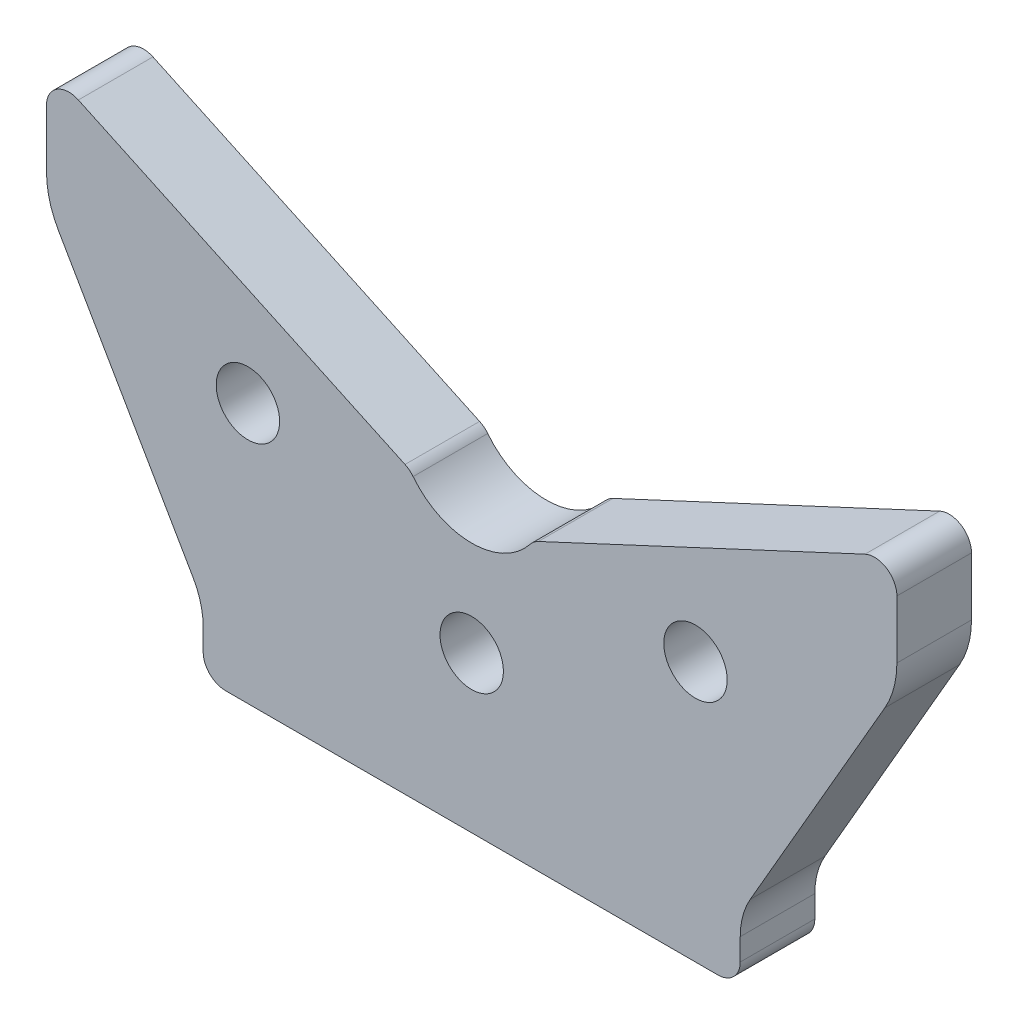
ISO-10303-21;
HEADER;
FILE_DESCRIPTION(('STEP AP214'),'2;1');
FILE_NAME('part.step','',(''),(''),'','','');
FILE_SCHEMA(('AUTOMOTIVE_DESIGN { 1 0 10303 214 1 1 1 1 }'));
ENDSEC;
DATA;
#1=APPLICATION_CONTEXT('core data for automotive mechanical design processes');
#2=APPLICATION_PROTOCOL_DEFINITION('international standard','automotive_design',2000,#1);
#3=PRODUCT_CONTEXT('',#1,'mechanical');
#4=PRODUCT('Part','Part','',(#3));
#5=PRODUCT_RELATED_PRODUCT_CATEGORY('part','',(#4));
#6=PRODUCT_DEFINITION_FORMATION('','',#4);
#7=PRODUCT_DEFINITION_CONTEXT('part definition',#1,'design');
#8=PRODUCT_DEFINITION('design','',#6,#7);
#9=PRODUCT_DEFINITION_SHAPE('','',#8);
#10=(LENGTH_UNIT() NAMED_UNIT(*) SI_UNIT(.MILLI.,.METRE.));
#11=(NAMED_UNIT(*) PLANE_ANGLE_UNIT() SI_UNIT($,.RADIAN.));
#12=(NAMED_UNIT(*) SI_UNIT($,.STERADIAN.) SOLID_ANGLE_UNIT());
#13=UNCERTAINTY_MEASURE_WITH_UNIT(LENGTH_MEASURE(1.E-05),#10,'distance_accuracy_value','');
#14=(GEOMETRIC_REPRESENTATION_CONTEXT(3) GLOBAL_UNCERTAINTY_ASSIGNED_CONTEXT((#13)) GLOBAL_UNIT_ASSIGNED_CONTEXT((#10,
#11,#12)) REPRESENTATION_CONTEXT('',''));
#15=CARTESIAN_POINT('',(0.,0.,0.));
#16=DIRECTION('',(0.,0.,1.));
#17=DIRECTION('',(1.,0.,0.));
#18=AXIS2_PLACEMENT_3D('',#15,#16,#17);
#19=CARTESIAN_POINT('',(0.,0.,10.));
#20=DIRECTION('',(0.,1.,0.));
#21=DIRECTION('',(-1.,0.,0.));
#22=AXIS2_PLACEMENT_3D('',#19,#20,#21);
#23=PLANE('',#22);
#24=DIRECTION('',(1.,0.,0.));
#25=VECTOR('',#24,1.);
#26=CARTESIAN_POINT('',(0.,0.,0.));
#27=LINE('',#26,#25);
#28=CARTESIAN_POINT('',(-33.,0.,0.));
#29=VERTEX_POINT('',#28);
#30=CARTESIAN_POINT('',(33.,0.,0.));
#31=VERTEX_POINT('',#30);
#32=EDGE_CURVE('E125',#29,#31,#27,.T.);
#33=ORIENTED_EDGE('',*,*,#32,.T.);
#34=DIRECTION('',(0.,0.,-1.));
#35=VECTOR('',#34,1.);
#36=CARTESIAN_POINT('',(33.,0.,10.));
#37=LINE('',#36,#35);
#38=CARTESIAN_POINT('',(33.,0.,10.));
#39=VERTEX_POINT('',#38);
#40=EDGE_CURVE('E11',#39,#31,#37,.T.);
#41=ORIENTED_EDGE('',*,*,#40,.F.);
#42=DIRECTION('',(1.,0.,0.));
#43=VECTOR('',#42,1.);
#44=CARTESIAN_POINT('',(0.,0.,10.));
#45=LINE('',#44,#43);
#46=CARTESIAN_POINT('',(-33.,0.,10.));
#47=VERTEX_POINT('',#46);
#48=EDGE_CURVE('E131',#47,#39,#45,.T.);
#49=ORIENTED_EDGE('',*,*,#48,.F.);
#50=DIRECTION('',(0.,0.,-1.));
#51=VECTOR('',#50,1.);
#52=CARTESIAN_POINT('',(-33.,0.,10.));
#53=LINE('',#52,#51);
#54=EDGE_CURVE('E201',#47,#29,#53,.T.);
#55=ORIENTED_EDGE('',*,*,#54,.T.);
#56=EDGE_LOOP('',(#33,#41,#49,#55));
#57=FACE_BOUND('',#56,.T.);
#58=ADVANCED_FACE('F36',(#57),#23,.F.);
#59=CARTESIAN_POINT('',(33.,3.,10.));
#60=DIRECTION('',(0.,0.,-1.));
#61=DIRECTION('',(-1.,0.,0.));
#62=AXIS2_PLACEMENT_3D('',#59,#60,#61);
#63=CYLINDRICAL_SURFACE('',#62,3.00000000000001);
#64=CARTESIAN_POINT('',(33.,3.,0.));
#65=DIRECTION('',(0.,0.,1.));
#66=DIRECTION('',(-1.,0.,0.));
#67=AXIS2_PLACEMENT_3D('',#64,#65,#66);
#68=CIRCLE('',#67,3.00000000000001);
#69=CARTESIAN_POINT('',(36.,3.,0.));
#70=VERTEX_POINT('',#69);
#71=EDGE_CURVE('E206',#31,#70,#68,.T.);
#72=ORIENTED_EDGE('',*,*,#71,.T.);
#73=DIRECTION('',(0.,0.,-1.));
#74=VECTOR('',#73,1.);
#75=CARTESIAN_POINT('',(36.,3.,10.));
#76=LINE('',#75,#74);
#77=CARTESIAN_POINT('',(36.,3.,10.));
#78=VERTEX_POINT('',#77);
#79=EDGE_CURVE('E45',#78,#70,#76,.T.);
#80=ORIENTED_EDGE('',*,*,#79,.F.);
#81=CARTESIAN_POINT('',(33.,3.,10.));
#82=DIRECTION('',(0.,0.,1.));
#83=DIRECTION('',(-1.,0.,0.));
#84=AXIS2_PLACEMENT_3D('',#81,#82,#83);
#85=CIRCLE('',#84,3.00000000000001);
#86=EDGE_CURVE('E352',#39,#78,#85,.T.);
#87=ORIENTED_EDGE('',*,*,#86,.F.);
#88=ORIENTED_EDGE('',*,*,#40,.T.);
#89=EDGE_LOOP('',(#72,#80,#87,#88));
#90=FACE_BOUND('',#89,.T.);
#91=ADVANCED_FACE('F357',(#90),#63,.T.);
#92=CARTESIAN_POINT('',(36.,3.,10.));
#93=DIRECTION('',(-1.,0.,0.));
#94=DIRECTION('',(0.,0.,1.));
#95=AXIS2_PLACEMENT_3D('',#92,#93,#94);
#96=PLANE('',#95);
#97=DIRECTION('',(0.,1.,0.));
#98=VECTOR('',#97,1.);
#99=CARTESIAN_POINT('',(36.,3.,0.));
#100=LINE('',#99,#98);
#101=CARTESIAN_POINT('',(36.,5.94744111674247,0.));
#102=VERTEX_POINT('',#101);
#103=EDGE_CURVE('E209',#70,#102,#100,.T.);
#104=ORIENTED_EDGE('',*,*,#103,.T.);
#105=DIRECTION('',(0.,0.,-1.));
#106=VECTOR('',#105,1.);
#107=CARTESIAN_POINT('',(36.,5.94744111674247,10.));
#108=LINE('',#107,#106);
#109=CARTESIAN_POINT('',(36.,5.94744111674247,10.));
#110=VERTEX_POINT('',#109);
#111=EDGE_CURVE('E286',#110,#102,#108,.T.);
#112=ORIENTED_EDGE('',*,*,#111,.F.);
#113=DIRECTION('',(0.,1.,0.));
#114=VECTOR('',#113,1.);
#115=CARTESIAN_POINT('',(36.,3.,10.));
#116=LINE('',#115,#114);
#117=EDGE_CURVE('E296',#78,#110,#116,.T.);
#118=ORIENTED_EDGE('',*,*,#117,.F.);
#119=ORIENTED_EDGE('',*,*,#79,.T.);
#120=EDGE_LOOP('',(#104,#112,#118,#119));
#121=FACE_BOUND('',#120,.T.);
#122=ADVANCED_FACE('F294',(#121),#96,.F.);
#123=CARTESIAN_POINT('',(46.,5.94744111674247,10.));
#124=DIRECTION('',(0.,0.,-1.));
#125=DIRECTION('',(-1.,0.,0.));
#126=AXIS2_PLACEMENT_3D('',#123,#124,#125);
#127=CYLINDRICAL_SURFACE('',#126,9.99999999999999);
#128=CARTESIAN_POINT('',(46.,5.94744111674247,0.));
#129=DIRECTION('',(0.,0.,-1.));
#130=DIRECTION('',(-1.,0.,0.));
#131=AXIS2_PLACEMENT_3D('',#128,#129,#130);
#132=CIRCLE('',#131,9.99999999999999);
#133=CARTESIAN_POINT('',(37.3397459621556,10.9474411167425,0.));
#134=VERTEX_POINT('',#133);
#135=EDGE_CURVE('E211',#102,#134,#132,.T.);
#136=ORIENTED_EDGE('',*,*,#135,.T.);
#137=DIRECTION('',(0.,0.,-1.));
#138=VECTOR('',#137,1.);
#139=CARTESIAN_POINT('',(37.3397459621556,10.9474411167425,10.));
#140=LINE('',#139,#138);
#141=CARTESIAN_POINT('',(37.3397459621556,10.9474411167425,10.));
#142=VERTEX_POINT('',#141);
#143=EDGE_CURVE('E283',#142,#134,#140,.T.);
#144=ORIENTED_EDGE('',*,*,#143,.F.);
#145=CARTESIAN_POINT('',(46.,5.94744111674247,10.));
#146=DIRECTION('',(0.,0.,-1.));
#147=DIRECTION('',(-1.,0.,0.));
#148=AXIS2_PLACEMENT_3D('',#145,#146,#147);
#149=CIRCLE('',#148,9.99999999999999);
#150=EDGE_CURVE('E314',#110,#142,#149,.T.);
#151=ORIENTED_EDGE('',*,*,#150,.F.);
#152=ORIENTED_EDGE('',*,*,#111,.T.);
#153=EDGE_LOOP('',(#136,#144,#151,#152));
#154=FACE_BOUND('',#153,.T.);
#155=ADVANCED_FACE('F305',(#154),#127,.F.);
#156=CARTESIAN_POINT('',(37.3397459621556,10.9474411167425,10.));
#157=DIRECTION('',(-0.866025403784438,0.500000000000002,0.));
#158=DIRECTION('',(-0.500000000000002,-0.866025403784438,0.));
#159=AXIS2_PLACEMENT_3D('',#156,#157,#158);
#160=PLANE('',#159);
#161=DIRECTION('',(0.500000000000002,0.866025403784438,0.));
#162=VECTOR('',#161,1.);
#163=CARTESIAN_POINT('',(37.3397459621556,10.9474411167425,0.));
#164=LINE('',#163,#162);
#165=CARTESIAN_POINT('',(55.3923048454133,42.2153903091735,0.));
#166=VERTEX_POINT('',#165);
#167=EDGE_CURVE('E213',#134,#166,#164,.T.);
#168=ORIENTED_EDGE('',*,*,#167,.T.);
#169=DIRECTION('',(0.,0.,-1.));
#170=VECTOR('',#169,1.);
#171=CARTESIAN_POINT('',(55.3923048454133,42.2153903091735,10.));
#172=LINE('',#171,#170);
#173=CARTESIAN_POINT('',(55.3923048454133,42.2153903091735,10.));
#174=VERTEX_POINT('',#173);
#175=EDGE_CURVE('E280',#174,#166,#172,.T.);
#176=ORIENTED_EDGE('',*,*,#175,.F.);
#177=DIRECTION('',(0.500000000000002,0.866025403784438,0.));
#178=VECTOR('',#177,1.);
#179=CARTESIAN_POINT('',(37.3397459621556,10.9474411167425,10.));
#180=LINE('',#179,#178);
#181=EDGE_CURVE('E311',#142,#174,#180,.T.);
#182=ORIENTED_EDGE('',*,*,#181,.F.);
#183=ORIENTED_EDGE('',*,*,#143,.T.);
#184=EDGE_LOOP('',(#168,#176,#182,#183));
#185=FACE_BOUND('',#184,.T.);
#186=ADVANCED_FACE('F309',(#185),#160,.F.);
#187=CARTESIAN_POINT('',(45.,48.2153903091735,10.));
#188=DIRECTION('',(0.,0.,-1.));
#189=DIRECTION('',(-1.,0.,0.));
#190=AXIS2_PLACEMENT_3D('',#187,#188,#189);
#191=CYLINDRICAL_SURFACE('',#190,12.);
#192=CARTESIAN_POINT('',(45.,48.2153903091735,0.));
#193=DIRECTION('',(0.,0.,1.));
#194=DIRECTION('',(1.,0.,0.));
#195=AXIS2_PLACEMENT_3D('',#192,#193,#194);
#196=CIRCLE('',#195,12.);
#197=CARTESIAN_POINT('',(57.,48.2153903091735,0.));
#198=VERTEX_POINT('',#197);
#199=EDGE_CURVE('E215',#166,#198,#196,.T.);
#200=ORIENTED_EDGE('',*,*,#199,.T.);
#201=DIRECTION('',(0.,0.,-1.));
#202=VECTOR('',#201,1.);
#203=CARTESIAN_POINT('',(57.,48.2153903091735,10.));
#204=LINE('',#203,#202);
#205=CARTESIAN_POINT('',(57.,48.2153903091735,10.));
#206=VERTEX_POINT('',#205);
#207=EDGE_CURVE('E277',#206,#198,#204,.T.);
#208=ORIENTED_EDGE('',*,*,#207,.F.);
#209=CARTESIAN_POINT('',(45.,48.2153903091735,10.));
#210=DIRECTION('',(0.,0.,1.));
#211=DIRECTION('',(1.,0.,0.));
#212=AXIS2_PLACEMENT_3D('',#209,#210,#211);
#213=CIRCLE('',#212,12.);
#214=EDGE_CURVE('E313',#174,#206,#213,.T.);
#215=ORIENTED_EDGE('',*,*,#214,.F.);
#216=ORIENTED_EDGE('',*,*,#175,.T.);
#217=EDGE_LOOP('',(#200,#208,#215,#216));
#218=FACE_BOUND('',#217,.T.);
#219=ADVANCED_FACE('F369',(#218),#191,.T.);
#220=CARTESIAN_POINT('',(57.,48.2153903091735,10.));
#221=DIRECTION('',(-1.,0.,0.));
#222=DIRECTION('',(0.,0.,1.));
#223=AXIS2_PLACEMENT_3D('',#220,#221,#222);
#224=PLANE('',#223);
#225=DIRECTION('',(0.,1.,0.));
#226=VECTOR('',#225,1.);
#227=CARTESIAN_POINT('',(57.,48.2153903091735,0.));
#228=LINE('',#227,#226);
#229=CARTESIAN_POINT('',(57.,56.,0.));
#230=VERTEX_POINT('',#229);
#231=EDGE_CURVE('E217',#198,#230,#228,.T.);
#232=ORIENTED_EDGE('',*,*,#231,.T.);
#233=DIRECTION('',(0.,0.,-1.));
#234=VECTOR('',#233,1.);
#235=CARTESIAN_POINT('',(57.,56.,10.));
#236=LINE('',#235,#234);
#237=CARTESIAN_POINT('',(57.,56.,10.));
#238=VERTEX_POINT('',#237);
#239=EDGE_CURVE('E274',#238,#230,#236,.T.);
#240=ORIENTED_EDGE('',*,*,#239,.F.);
#241=DIRECTION('',(0.,1.,0.));
#242=VECTOR('',#241,1.);
#243=CARTESIAN_POINT('',(57.,48.2153903091735,10.));
#244=LINE('',#243,#242);
#245=EDGE_CURVE('E316',#206,#238,#244,.T.);
#246=ORIENTED_EDGE('',*,*,#245,.F.);
#247=ORIENTED_EDGE('',*,*,#207,.T.);
#248=EDGE_LOOP('',(#232,#240,#246,#247));
#249=FACE_BOUND('',#248,.T.);
#250=ADVANCED_FACE('F372',(#249),#224,.F.);
#251=CARTESIAN_POINT('',(54.,56.,10.));
#252=DIRECTION('',(0.,0.,-1.));
#253=DIRECTION('',(-1.,0.,0.));
#254=AXIS2_PLACEMENT_3D('',#251,#252,#253);
#255=CYLINDRICAL_SURFACE('',#254,3.);
#256=CARTESIAN_POINT('',(54.,56.,0.));
#257=DIRECTION('',(0.,0.,1.));
#258=DIRECTION('',(-1.,0.,0.));
#259=AXIS2_PLACEMENT_3D('',#256,#257,#258);
#260=CIRCLE('',#259,3.);
#261=CARTESIAN_POINT('',(52.7321452147779,58.7189233611099,0.));
#262=VERTEX_POINT('',#261);
#263=EDGE_CURVE('E219',#230,#262,#260,.T.);
#264=ORIENTED_EDGE('',*,*,#263,.T.);
#265=DIRECTION('',(0.,0.,-1.));
#266=VECTOR('',#265,1.);
#267=CARTESIAN_POINT('',(52.7321452147779,58.7189233611099,10.));
#268=LINE('',#267,#266);
#269=CARTESIAN_POINT('',(52.7321452147779,58.7189233611099,10.));
#270=VERTEX_POINT('',#269);
#271=EDGE_CURVE('E271',#270,#262,#268,.T.);
#272=ORIENTED_EDGE('',*,*,#271,.F.);
#273=CARTESIAN_POINT('',(54.,56.,10.));
#274=DIRECTION('',(0.,0.,1.));
#275=DIRECTION('',(-1.,0.,0.));
#276=AXIS2_PLACEMENT_3D('',#273,#274,#275);
#277=CIRCLE('',#276,3.);
#278=EDGE_CURVE('E322',#238,#270,#277,.T.);
#279=ORIENTED_EDGE('',*,*,#278,.F.);
#280=ORIENTED_EDGE('',*,*,#239,.T.);
#281=EDGE_LOOP('',(#264,#272,#279,#280));
#282=FACE_BOUND('',#281,.T.);
#283=ADVANCED_FACE('F376',(#282),#255,.T.);
#284=CARTESIAN_POINT('',(52.7321452147779,58.7189233611099,10.));
#285=DIRECTION('',(0.422618261740706,-0.906307787036647,0.));
#286=DIRECTION('',(0.906307787036647,0.422618261740706,0.));
#287=AXIS2_PLACEMENT_3D('',#284,#285,#286);
#288=PLANE('',#287);
#289=DIRECTION('',(-0.906307787036647,-0.422618261740706,0.));
#290=VECTOR('',#289,1.);
#291=CARTESIAN_POINT('',(52.7321452147779,58.7189233611099,0.));
#292=LINE('',#291,#290);
#293=CARTESIAN_POINT('',(8.93961735786248,38.2981322514638,0.));
#294=VERTEX_POINT('',#293);
#295=EDGE_CURVE('E221',#262,#294,#292,.T.);
#296=ORIENTED_EDGE('',*,*,#295,.T.);
#297=DIRECTION('',(0.,0.,-1.));
#298=VECTOR('',#297,1.);
#299=CARTESIAN_POINT('',(8.93961735786248,38.2981322514638,10.));
#300=LINE('',#299,#298);
#301=CARTESIAN_POINT('',(8.93961735786248,38.2981322514638,10.));
#302=VERTEX_POINT('',#301);
#303=EDGE_CURVE('E268',#302,#294,#300,.T.);
#304=ORIENTED_EDGE('',*,*,#303,.F.);
#305=DIRECTION('',(-0.906307787036647,-0.422618261740706,0.));
#306=VECTOR('',#305,1.);
#307=CARTESIAN_POINT('',(52.7321452147779,58.7189233611099,10.));
#308=LINE('',#307,#306);
#309=EDGE_CURVE('E324',#270,#302,#308,.T.);
#310=ORIENTED_EDGE('',*,*,#309,.F.);
#311=ORIENTED_EDGE('',*,*,#271,.T.);
#312=EDGE_LOOP('',(#296,#304,#310,#311));
#313=FACE_BOUND('',#312,.T.);
#314=ADVANCED_FACE('F380',(#313),#288,.F.);
#315=CARTESIAN_POINT('',(10.2074721430846,35.5792088903539,10.));
#316=DIRECTION('',(0.,0.,-1.));
#317=DIRECTION('',(-1.,0.,0.));
#318=AXIS2_PLACEMENT_3D('',#315,#316,#317);
#319=CYLINDRICAL_SURFACE('',#318,2.99999999999999);
#320=CARTESIAN_POINT('',(10.2074721430846,35.5792088903539,0.));
#321=DIRECTION('',(0.,0.,1.));
#322=DIRECTION('',(-1.,0.,0.));
#323=AXIS2_PLACEMENT_3D('',#320,#321,#322);
#324=CIRCLE('',#323,2.99999999999999);
#325=CARTESIAN_POINT('',(7.85190164852662,37.4369730425454,0.));
#326=VERTEX_POINT('',#325);
#327=EDGE_CURVE('E223',#294,#326,#324,.T.);
#328=ORIENTED_EDGE('',*,*,#327,.T.);
#329=DIRECTION('',(0.,0.,-1.));
#330=VECTOR('',#329,1.);
#331=CARTESIAN_POINT('',(7.85190164852662,37.4369730425454,10.));
#332=LINE('',#331,#330);
#333=CARTESIAN_POINT('',(7.85190164852662,37.4369730425454,10.));
#334=VERTEX_POINT('',#333);
#335=EDGE_CURVE('E265',#334,#326,#332,.T.);
#336=ORIENTED_EDGE('',*,*,#335,.F.);
#337=CARTESIAN_POINT('',(10.2074721430846,35.5792088903539,10.));
#338=DIRECTION('',(0.,0.,1.));
#339=DIRECTION('',(-1.,0.,0.));
#340=AXIS2_PLACEMENT_3D('',#337,#338,#339);
#341=CIRCLE('',#340,2.99999999999999);
#342=EDGE_CURVE('E326',#302,#334,#341,.T.);
#343=ORIENTED_EDGE('',*,*,#342,.F.);
#344=ORIENTED_EDGE('',*,*,#303,.T.);
#345=EDGE_LOOP('',(#328,#336,#343,#344));
#346=FACE_BOUND('',#345,.T.);
#347=ADVANCED_FACE('F384',(#346),#319,.T.);
#348=CARTESIAN_POINT('',(0.,43.6295202165171,10.));
#349=DIRECTION('',(0.,0.,-1.));
#350=DIRECTION('',(-1.,0.,0.));
#351=AXIS2_PLACEMENT_3D('',#348,#349,#350);
#352=CYLINDRICAL_SURFACE('',#351,10.);
#353=CARTESIAN_POINT('',(0.,43.6295202165171,0.));
#354=DIRECTION('',(0.,0.,-1.));
#355=DIRECTION('',(1.,0.,0.));
#356=AXIS2_PLACEMENT_3D('',#353,#354,#355);
#357=CIRCLE('',#356,10.);
#358=CARTESIAN_POINT('',(-7.85190164852661,37.4369730425454,0.));
#359=VERTEX_POINT('',#358);
#360=EDGE_CURVE('E225',#326,#359,#357,.T.);
#361=ORIENTED_EDGE('',*,*,#360,.T.);
#362=DIRECTION('',(0.,0.,-1.));
#363=VECTOR('',#362,1.);
#364=CARTESIAN_POINT('',(-7.85190164852661,37.4369730425454,10.));
#365=LINE('',#364,#363);
#366=CARTESIAN_POINT('',(-7.85190164852661,37.4369730425454,10.));
#367=VERTEX_POINT('',#366);
#368=EDGE_CURVE('E262',#367,#359,#365,.T.);
#369=ORIENTED_EDGE('',*,*,#368,.F.);
#370=CARTESIAN_POINT('',(0.,43.6295202165171,10.));
#371=DIRECTION('',(0.,0.,-1.));
#372=DIRECTION('',(1.,0.,0.));
#373=AXIS2_PLACEMENT_3D('',#370,#371,#372);
#374=CIRCLE('',#373,10.);
#375=EDGE_CURVE('E328',#334,#367,#374,.T.);
#376=ORIENTED_EDGE('',*,*,#375,.F.);
#377=ORIENTED_EDGE('',*,*,#335,.T.);
#378=EDGE_LOOP('',(#361,#369,#376,#377));
#379=FACE_BOUND('',#378,.T.);
#380=ADVANCED_FACE('F388',(#379),#352,.F.);
#381=CARTESIAN_POINT('',(-10.2074721430846,35.5792088903539,10.));
#382=DIRECTION('',(0.,0.,-1.));
#383=DIRECTION('',(-1.,0.,0.));
#384=AXIS2_PLACEMENT_3D('',#381,#382,#383);
#385=CYLINDRICAL_SURFACE('',#384,2.99999999999999);
#386=CARTESIAN_POINT('',(-10.2074721430846,35.5792088903539,0.));
#387=DIRECTION('',(0.,0.,1.));
#388=DIRECTION('',(1.,0.,0.));
#389=AXIS2_PLACEMENT_3D('',#386,#387,#388);
#390=CIRCLE('',#389,2.99999999999999);
#391=CARTESIAN_POINT('',(-8.93961735786248,38.2981322514638,0.));
#392=VERTEX_POINT('',#391);
#393=EDGE_CURVE('E227',#359,#392,#390,.T.);
#394=ORIENTED_EDGE('',*,*,#393,.T.);
#395=DIRECTION('',(0.,0.,-1.));
#396=VECTOR('',#395,1.);
#397=CARTESIAN_POINT('',(-8.93961735786248,38.2981322514638,10.));
#398=LINE('',#397,#396);
#399=CARTESIAN_POINT('',(-8.93961735786248,38.2981322514638,10.));
#400=VERTEX_POINT('',#399);
#401=EDGE_CURVE('E259',#400,#392,#398,.T.);
#402=ORIENTED_EDGE('',*,*,#401,.F.);
#403=CARTESIAN_POINT('',(-10.2074721430846,35.5792088903539,10.));
#404=DIRECTION('',(0.,0.,1.));
#405=DIRECTION('',(1.,0.,0.));
#406=AXIS2_PLACEMENT_3D('',#403,#404,#405);
#407=CIRCLE('',#406,2.99999999999999);
#408=EDGE_CURVE('E330',#367,#400,#407,.T.);
#409=ORIENTED_EDGE('',*,*,#408,.F.);
#410=ORIENTED_EDGE('',*,*,#368,.T.);
#411=EDGE_LOOP('',(#394,#402,#409,#410));
#412=FACE_BOUND('',#411,.T.);
#413=ADVANCED_FACE('F392',(#412),#385,.T.);
#414=CARTESIAN_POINT('',(-52.7321452147779,58.7189233611099,10.));
#415=DIRECTION('',(-0.422618261740706,-0.906307787036647,0.));
#416=DIRECTION('',(0.906307787036647,-0.422618261740706,0.));
#417=AXIS2_PLACEMENT_3D('',#414,#415,#416);
#418=PLANE('',#417);
#419=DIRECTION('',(-0.906307787036647,0.422618261740706,0.));
#420=VECTOR('',#419,1.);
#421=CARTESIAN_POINT('',(-52.7321452147779,58.7189233611099,0.));
#422=LINE('',#421,#420);
#423=CARTESIAN_POINT('',(-52.7321452147779,58.7189233611099,0.));
#424=VERTEX_POINT('',#423);
#425=EDGE_CURVE('E229',#392,#424,#422,.T.);
#426=ORIENTED_EDGE('',*,*,#425,.T.);
#427=DIRECTION('',(0.,0.,-1.));
#428=VECTOR('',#427,1.);
#429=CARTESIAN_POINT('',(-52.7321452147779,58.7189233611099,10.));
#430=LINE('',#429,#428);
#431=CARTESIAN_POINT('',(-52.7321452147779,58.7189233611099,10.));
#432=VERTEX_POINT('',#431);
#433=EDGE_CURVE('E256',#432,#424,#430,.T.);
#434=ORIENTED_EDGE('',*,*,#433,.F.);
#435=DIRECTION('',(-0.906307787036647,0.422618261740706,0.));
#436=VECTOR('',#435,1.);
#437=CARTESIAN_POINT('',(-52.7321452147779,58.7189233611099,10.));
#438=LINE('',#437,#436);
#439=EDGE_CURVE('E332',#400,#432,#438,.T.);
#440=ORIENTED_EDGE('',*,*,#439,.F.);
#441=ORIENTED_EDGE('',*,*,#401,.T.);
#442=EDGE_LOOP('',(#426,#434,#440,#441));
#443=FACE_BOUND('',#442,.T.);
#444=ADVANCED_FACE('F396',(#443),#418,.F.);
#445=CARTESIAN_POINT('',(-54.,56.,10.));
#446=DIRECTION('',(0.,0.,-1.));
#447=DIRECTION('',(-1.,0.,0.));
#448=AXIS2_PLACEMENT_3D('',#445,#446,#447);
#449=CYLINDRICAL_SURFACE('',#448,3.);
#450=CARTESIAN_POINT('',(-54.,56.,0.));
#451=DIRECTION('',(0.,0.,1.));
#452=DIRECTION('',(-1.,0.,0.));
#453=AXIS2_PLACEMENT_3D('',#450,#451,#452);
#454=CIRCLE('',#453,3.);
#455=CARTESIAN_POINT('',(-57.,56.,0.));
#456=VERTEX_POINT('',#455);
#457=EDGE_CURVE('E231',#424,#456,#454,.T.);
#458=ORIENTED_EDGE('',*,*,#457,.T.);
#459=DIRECTION('',(0.,0.,-1.));
#460=VECTOR('',#459,1.);
#461=CARTESIAN_POINT('',(-57.,56.,10.));
#462=LINE('',#461,#460);
#463=CARTESIAN_POINT('',(-57.,56.,10.));
#464=VERTEX_POINT('',#463);
#465=EDGE_CURVE('E253',#464,#456,#462,.T.);
#466=ORIENTED_EDGE('',*,*,#465,.F.);
#467=CARTESIAN_POINT('',(-54.,56.,10.));
#468=DIRECTION('',(0.,0.,1.));
#469=DIRECTION('',(-1.,0.,0.));
#470=AXIS2_PLACEMENT_3D('',#467,#468,#469);
#471=CIRCLE('',#470,3.);
#472=EDGE_CURVE('E334',#432,#464,#471,.T.);
#473=ORIENTED_EDGE('',*,*,#472,.F.);
#474=ORIENTED_EDGE('',*,*,#433,.T.);
#475=EDGE_LOOP('',(#458,#466,#473,#474));
#476=FACE_BOUND('',#475,.T.);
#477=ADVANCED_FACE('F400',(#476),#449,.T.);
#478=CARTESIAN_POINT('',(-57.,48.2153903091735,10.));
#479=DIRECTION('',(1.,0.,0.));
#480=DIRECTION('',(0.,0.,-1.));
#481=AXIS2_PLACEMENT_3D('',#478,#479,#480);
#482=PLANE('',#481);
#483=DIRECTION('',(0.,-1.,0.));
#484=VECTOR('',#483,1.);
#485=CARTESIAN_POINT('',(-57.,48.2153903091735,0.));
#486=LINE('',#485,#484);
#487=CARTESIAN_POINT('',(-57.,48.2153903091735,0.));
#488=VERTEX_POINT('',#487);
#489=EDGE_CURVE('E233',#456,#488,#486,.T.);
#490=ORIENTED_EDGE('',*,*,#489,.T.);
#491=DIRECTION('',(0.,0.,-1.));
#492=VECTOR('',#491,1.);
#493=CARTESIAN_POINT('',(-57.,48.2153903091735,10.));
#494=LINE('',#493,#492);
#495=CARTESIAN_POINT('',(-57.,48.2153903091735,10.));
#496=VERTEX_POINT('',#495);
#497=EDGE_CURVE('E250',#496,#488,#494,.T.);
#498=ORIENTED_EDGE('',*,*,#497,.F.);
#499=DIRECTION('',(0.,-1.,0.));
#500=VECTOR('',#499,1.);
#501=CARTESIAN_POINT('',(-57.,48.2153903091735,10.));
#502=LINE('',#501,#500);
#503=EDGE_CURVE('E336',#464,#496,#502,.T.);
#504=ORIENTED_EDGE('',*,*,#503,.F.);
#505=ORIENTED_EDGE('',*,*,#465,.T.);
#506=EDGE_LOOP('',(#490,#498,#504,#505));
#507=FACE_BOUND('',#506,.T.);
#508=ADVANCED_FACE('F404',(#507),#482,.F.);
#509=CARTESIAN_POINT('',(-45.,48.2153903091735,10.));
#510=DIRECTION('',(0.,0.,-1.));
#511=DIRECTION('',(-1.,0.,0.));
#512=AXIS2_PLACEMENT_3D('',#509,#510,#511);
#513=CYLINDRICAL_SURFACE('',#512,12.);
#514=CARTESIAN_POINT('',(-45.,48.2153903091735,0.));
#515=DIRECTION('',(0.,0.,1.));
#516=DIRECTION('',(-1.,0.,0.));
#517=AXIS2_PLACEMENT_3D('',#514,#515,#516);
#518=CIRCLE('',#517,12.);
#519=CARTESIAN_POINT('',(-55.3923048454133,42.2153903091735,0.));
#520=VERTEX_POINT('',#519);
#521=EDGE_CURVE('E235',#488,#520,#518,.T.);
#522=ORIENTED_EDGE('',*,*,#521,.T.);
#523=DIRECTION('',(0.,0.,-1.));
#524=VECTOR('',#523,1.);
#525=CARTESIAN_POINT('',(-55.3923048454133,42.2153903091735,10.));
#526=LINE('',#525,#524);
#527=CARTESIAN_POINT('',(-55.3923048454133,42.2153903091735,10.));
#528=VERTEX_POINT('',#527);
#529=EDGE_CURVE('E247',#528,#520,#526,.T.);
#530=ORIENTED_EDGE('',*,*,#529,.F.);
#531=CARTESIAN_POINT('',(-45.,48.2153903091735,10.));
#532=DIRECTION('',(0.,0.,1.));
#533=DIRECTION('',(-1.,0.,0.));
#534=AXIS2_PLACEMENT_3D('',#531,#532,#533);
#535=CIRCLE('',#534,12.);
#536=EDGE_CURVE('E338',#496,#528,#535,.T.);
#537=ORIENTED_EDGE('',*,*,#536,.F.);
#538=ORIENTED_EDGE('',*,*,#497,.T.);
#539=EDGE_LOOP('',(#522,#530,#537,#538));
#540=FACE_BOUND('',#539,.T.);
#541=ADVANCED_FACE('F344',(#540),#513,.T.);
#542=CARTESIAN_POINT('',(-37.3397459621556,10.9474411167425,10.));
#543=DIRECTION('',(0.866025403784438,0.500000000000002,0.));
#544=DIRECTION('',(-0.500000000000002,0.866025403784438,0.));
#545=AXIS2_PLACEMENT_3D('',#542,#543,#544);
#546=PLANE('',#545);
#547=DIRECTION('',(0.500000000000002,-0.866025403784438,0.));
#548=VECTOR('',#547,1.);
#549=CARTESIAN_POINT('',(-37.3397459621556,10.9474411167425,0.));
#550=LINE('',#549,#548);
#551=CARTESIAN_POINT('',(-37.3397459621556,10.9474411167425,0.));
#552=VERTEX_POINT('',#551);
#553=EDGE_CURVE('E237',#520,#552,#550,.T.);
#554=ORIENTED_EDGE('',*,*,#553,.T.);
#555=DIRECTION('',(0.,0.,-1.));
#556=VECTOR('',#555,1.);
#557=CARTESIAN_POINT('',(-37.3397459621556,10.9474411167425,10.));
#558=LINE('',#557,#556);
#559=CARTESIAN_POINT('',(-37.3397459621556,10.9474411167425,10.));
#560=VERTEX_POINT('',#559);
#561=EDGE_CURVE('E196',#560,#552,#558,.T.);
#562=ORIENTED_EDGE('',*,*,#561,.F.);
#563=DIRECTION('',(0.500000000000002,-0.866025403784438,0.));
#564=VECTOR('',#563,1.);
#565=CARTESIAN_POINT('',(-37.3397459621556,10.9474411167425,10.));
#566=LINE('',#565,#564);
#567=EDGE_CURVE('E187',#528,#560,#566,.T.);
#568=ORIENTED_EDGE('',*,*,#567,.F.);
#569=ORIENTED_EDGE('',*,*,#529,.T.);
#570=EDGE_LOOP('',(#554,#562,#568,#569));
#571=FACE_BOUND('',#570,.T.);
#572=ADVANCED_FACE('F348',(#571),#546,.F.);
#573=CARTESIAN_POINT('',(-46.,5.94744111674247,10.));
#574=DIRECTION('',(0.,0.,-1.));
#575=DIRECTION('',(-1.,0.,0.));
#576=AXIS2_PLACEMENT_3D('',#573,#574,#575);
#577=CYLINDRICAL_SURFACE('',#576,9.99999999999999);
#578=CARTESIAN_POINT('',(-46.,5.94744111674247,0.));
#579=DIRECTION('',(0.,0.,-1.));
#580=DIRECTION('',(1.,0.,0.));
#581=AXIS2_PLACEMENT_3D('',#578,#579,#580);
#582=CIRCLE('',#581,9.99999999999999);
#583=CARTESIAN_POINT('',(-36.,5.94744111674247,0.));
#584=VERTEX_POINT('',#583);
#585=EDGE_CURVE('E195',#552,#584,#582,.T.);
#586=ORIENTED_EDGE('',*,*,#585,.T.);
#587=DIRECTION('',(0.,0.,-1.));
#588=VECTOR('',#587,1.);
#589=CARTESIAN_POINT('',(-36.,5.94744111674247,10.));
#590=LINE('',#589,#588);
#591=CARTESIAN_POINT('',(-36.,5.94744111674247,10.));
#592=VERTEX_POINT('',#591);
#593=EDGE_CURVE('E192',#592,#584,#590,.T.);
#594=ORIENTED_EDGE('',*,*,#593,.F.);
#595=CARTESIAN_POINT('',(-46.,5.94744111674247,10.));
#596=DIRECTION('',(0.,0.,-1.));
#597=DIRECTION('',(1.,0.,0.));
#598=AXIS2_PLACEMENT_3D('',#595,#596,#597);
#599=CIRCLE('',#598,9.99999999999999);
#600=EDGE_CURVE('E181',#560,#592,#599,.T.);
#601=ORIENTED_EDGE('',*,*,#600,.F.);
#602=ORIENTED_EDGE('',*,*,#561,.T.);
#603=EDGE_LOOP('',(#586,#594,#601,#602));
#604=FACE_BOUND('',#603,.T.);
#605=ADVANCED_FACE('F193',(#604),#577,.F.);
#606=CARTESIAN_POINT('',(-36.,3.,10.));
#607=DIRECTION('',(1.,0.,0.));
#608=DIRECTION('',(0.,0.,-1.));
#609=AXIS2_PLACEMENT_3D('',#606,#607,#608);
#610=PLANE('',#609);
#611=DIRECTION('',(0.,-1.,0.));
#612=VECTOR('',#611,1.);
#613=CARTESIAN_POINT('',(-36.,3.,0.));
#614=LINE('',#613,#612);
#615=CARTESIAN_POINT('',(-36.,3.,0.));
#616=VERTEX_POINT('',#615);
#617=EDGE_CURVE('E118',#584,#616,#614,.T.);
#618=ORIENTED_EDGE('',*,*,#617,.T.);
#619=DIRECTION('',(0.,0.,-1.));
#620=VECTOR('',#619,1.);
#621=CARTESIAN_POINT('',(-36.,3.,10.));
#622=LINE('',#621,#620);
#623=CARTESIAN_POINT('',(-36.,3.,10.));
#624=VERTEX_POINT('',#623);
#625=EDGE_CURVE('E197',#624,#616,#622,.T.);
#626=ORIENTED_EDGE('',*,*,#625,.F.);
#627=DIRECTION('',(0.,-1.,0.));
#628=VECTOR('',#627,1.);
#629=CARTESIAN_POINT('',(-36.,3.,10.));
#630=LINE('',#629,#628);
#631=EDGE_CURVE('E185',#592,#624,#630,.T.);
#632=ORIENTED_EDGE('',*,*,#631,.F.);
#633=ORIENTED_EDGE('',*,*,#593,.T.);
#634=EDGE_LOOP('',(#618,#626,#632,#633));
#635=FACE_BOUND('',#634,.T.);
#636=ADVANCED_FACE('F199',(#635),#610,.F.);
#637=CARTESIAN_POINT('',(-33.,3.,10.));
#638=DIRECTION('',(0.,0.,-1.));
#639=DIRECTION('',(-1.,0.,0.));
#640=AXIS2_PLACEMENT_3D('',#637,#638,#639);
#641=CYLINDRICAL_SURFACE('',#640,3.00000000000001);
#642=CARTESIAN_POINT('',(-33.,3.,0.));
#643=DIRECTION('',(0.,0.,1.));
#644=DIRECTION('',(1.,0.,0.));
#645=AXIS2_PLACEMENT_3D('',#642,#643,#644);
#646=CIRCLE('',#645,3.00000000000001);
#647=EDGE_CURVE('E241',#616,#29,#646,.T.);
#648=ORIENTED_EDGE('',*,*,#647,.T.);
#649=ORIENTED_EDGE('',*,*,#54,.F.);
#650=CARTESIAN_POINT('',(-33.,3.,10.));
#651=DIRECTION('',(0.,0.,1.));
#652=DIRECTION('',(1.,0.,0.));
#653=AXIS2_PLACEMENT_3D('',#650,#651,#652);
#654=CIRCLE('',#653,3.00000000000001);
#655=EDGE_CURVE('E53',#624,#47,#654,.T.);
#656=ORIENTED_EDGE('',*,*,#655,.F.);
#657=ORIENTED_EDGE('',*,*,#625,.T.);
#658=EDGE_LOOP('',(#648,#649,#656,#657));
#659=FACE_BOUND('',#658,.T.);
#660=ADVANCED_FACE('F350',(#659),#641,.T.);
#661=CARTESIAN_POINT('',(-33.,3.,10.));
#662=DIRECTION('',(0.,0.,1.));
#663=DIRECTION('',(1.,0.,0.));
#664=AXIS2_PLACEMENT_3D('',#661,#662,#663);
#665=PLANE('',#664);
#666=CARTESIAN_POINT('',(-30.,34.8782149336174,10.));
#667=DIRECTION('',(0.,0.,1.));
#668=DIRECTION('',(1.,0.,0.));
#669=AXIS2_PLACEMENT_3D('',#666,#667,#668);
#670=CIRCLE('',#669,4.25);
#671=CARTESIAN_POINT('',(-25.75,34.8782149336174,10.));
#672=VERTEX_POINT('',#671);
#673=EDGE_CURVE('E441',#672,#672,#670,.T.);
#674=ORIENTED_EDGE('',*,*,#673,.F.);
#675=EDGE_LOOP('',(#674));
#676=FACE_BOUND('',#675,.T.);
#677=CARTESIAN_POINT('',(30.,34.8782149336174,10.));
#678=DIRECTION('',(0.,0.,1.));
#679=DIRECTION('',(1.,0.,0.));
#680=AXIS2_PLACEMENT_3D('',#677,#678,#679);
#681=CIRCLE('',#680,4.25);
#682=CARTESIAN_POINT('',(34.25,34.8782149336174,10.));
#683=VERTEX_POINT('',#682);
#684=EDGE_CURVE('E444',#683,#683,#681,.T.);
#685=ORIENTED_EDGE('',*,*,#684,.F.);
#686=EDGE_LOOP('',(#685));
#687=FACE_BOUND('',#686,.T.);
#688=CARTESIAN_POINT('',(0.,20.8782149336174,10.));
#689=DIRECTION('',(0.,0.,1.));
#690=DIRECTION('',(1.,0.,0.));
#691=AXIS2_PLACEMENT_3D('',#688,#689,#690);
#692=CIRCLE('',#691,4.25);
#693=CARTESIAN_POINT('',(4.25,20.8782149336174,10.));
#694=VERTEX_POINT('',#693);
#695=EDGE_CURVE('E451',#694,#694,#692,.T.);
#696=ORIENTED_EDGE('',*,*,#695,.F.);
#697=EDGE_LOOP('',(#696));
#698=FACE_BOUND('',#697,.T.);
#699=ORIENTED_EDGE('',*,*,#48,.T.);
#700=ORIENTED_EDGE('',*,*,#86,.T.);
#701=ORIENTED_EDGE('',*,*,#117,.T.);
#702=ORIENTED_EDGE('',*,*,#150,.T.);
#703=ORIENTED_EDGE('',*,*,#181,.T.);
#704=ORIENTED_EDGE('',*,*,#214,.T.);
#705=ORIENTED_EDGE('',*,*,#245,.T.);
#706=ORIENTED_EDGE('',*,*,#278,.T.);
#707=ORIENTED_EDGE('',*,*,#309,.T.);
#708=ORIENTED_EDGE('',*,*,#342,.T.);
#709=ORIENTED_EDGE('',*,*,#375,.T.);
#710=ORIENTED_EDGE('',*,*,#408,.T.);
#711=ORIENTED_EDGE('',*,*,#439,.T.);
#712=ORIENTED_EDGE('',*,*,#472,.T.);
#713=ORIENTED_EDGE('',*,*,#503,.T.);
#714=ORIENTED_EDGE('',*,*,#536,.T.);
#715=ORIENTED_EDGE('',*,*,#567,.T.);
#716=ORIENTED_EDGE('',*,*,#600,.T.);
#717=ORIENTED_EDGE('',*,*,#631,.T.);
#718=ORIENTED_EDGE('',*,*,#655,.T.);
#719=EDGE_LOOP('',(#699,#700,#701,#702,#703,#704,#705,#706,#707,#708,#709,#710,#711,#712,#713,
#714,#715,#716,#717,#718));
#720=FACE_BOUND('',#719,.T.);
#721=ADVANCED_FACE('F183',(#676,#687,#698,#720),#665,.T.);
#722=CARTESIAN_POINT('',(-33.,3.,0.));
#723=DIRECTION('',(0.,0.,1.));
#724=DIRECTION('',(1.,0.,0.));
#725=AXIS2_PLACEMENT_3D('',#722,#723,#724);
#726=PLANE('',#725);
#727=CARTESIAN_POINT('',(-30.,34.8782149336174,0.));
#728=DIRECTION('',(0.,0.,1.));
#729=DIRECTION('',(1.,0.,0.));
#730=AXIS2_PLACEMENT_3D('',#727,#728,#729);
#731=CIRCLE('',#730,4.25);
#732=CARTESIAN_POINT('',(-25.75,34.8782149336174,0.));
#733=VERTEX_POINT('',#732);
#734=EDGE_CURVE('E39',#733,#733,#731,.T.);
#735=ORIENTED_EDGE('',*,*,#734,.T.);
#736=EDGE_LOOP('',(#735));
#737=FACE_BOUND('',#736,.T.);
#738=CARTESIAN_POINT('',(30.,34.8782149336174,0.));
#739=DIRECTION('',(0.,0.,1.));
#740=DIRECTION('',(1.,0.,0.));
#741=AXIS2_PLACEMENT_3D('',#738,#739,#740);
#742=CIRCLE('',#741,4.25);
#743=CARTESIAN_POINT('',(34.25,34.8782149336174,0.));
#744=VERTEX_POINT('',#743);
#745=EDGE_CURVE('E446',#744,#744,#742,.T.);
#746=ORIENTED_EDGE('',*,*,#745,.T.);
#747=EDGE_LOOP('',(#746));
#748=FACE_BOUND('',#747,.T.);
#749=CARTESIAN_POINT('',(0.,20.8782149336174,0.));
#750=DIRECTION('',(0.,0.,1.));
#751=DIRECTION('',(1.,0.,0.));
#752=AXIS2_PLACEMENT_3D('',#749,#750,#751);
#753=CIRCLE('',#752,4.25);
#754=CARTESIAN_POINT('',(4.25,20.8782149336174,0.));
#755=VERTEX_POINT('',#754);
#756=EDGE_CURVE('E207',#755,#755,#753,.T.);
#757=ORIENTED_EDGE('',*,*,#756,.T.);
#758=EDGE_LOOP('',(#757));
#759=FACE_BOUND('',#758,.T.);
#760=ORIENTED_EDGE('',*,*,#32,.F.);
#761=ORIENTED_EDGE('',*,*,#647,.F.);
#762=ORIENTED_EDGE('',*,*,#617,.F.);
#763=ORIENTED_EDGE('',*,*,#585,.F.);
#764=ORIENTED_EDGE('',*,*,#553,.F.);
#765=ORIENTED_EDGE('',*,*,#521,.F.);
#766=ORIENTED_EDGE('',*,*,#489,.F.);
#767=ORIENTED_EDGE('',*,*,#457,.F.);
#768=ORIENTED_EDGE('',*,*,#425,.F.);
#769=ORIENTED_EDGE('',*,*,#393,.F.);
#770=ORIENTED_EDGE('',*,*,#360,.F.);
#771=ORIENTED_EDGE('',*,*,#327,.F.);
#772=ORIENTED_EDGE('',*,*,#295,.F.);
#773=ORIENTED_EDGE('',*,*,#263,.F.);
#774=ORIENTED_EDGE('',*,*,#231,.F.);
#775=ORIENTED_EDGE('',*,*,#199,.F.);
#776=ORIENTED_EDGE('',*,*,#167,.F.);
#777=ORIENTED_EDGE('',*,*,#135,.F.);
#778=ORIENTED_EDGE('',*,*,#103,.F.);
#779=ORIENTED_EDGE('',*,*,#71,.F.);
#780=EDGE_LOOP('',(#760,#761,#762,#763,#764,#765,#766,#767,#768,#769,#770,#771,#772,#773,#774,
#775,#776,#777,#778,#779));
#781=FACE_BOUND('',#780,.T.);
#782=ADVANCED_FACE('F300',(#737,#748,#759,#781),#726,.F.);
#783=CARTESIAN_POINT('',(0.,20.8782149336174,10.));
#784=DIRECTION('',(0.,0.,1.));
#785=DIRECTION('',(1.,0.,0.));
#786=AXIS2_PLACEMENT_3D('',#783,#784,#785);
#787=CYLINDRICAL_SURFACE('',#786,4.25);
#788=ORIENTED_EDGE('',*,*,#695,.T.);
#789=EDGE_LOOP('',(#788));
#790=FACE_BOUND('',#789,.T.);
#791=ORIENTED_EDGE('',*,*,#756,.F.);
#792=EDGE_LOOP('',(#791));
#793=FACE_BOUND('',#792,.T.);
#794=ADVANCED_FACE('F421',(#790,#793),#787,.F.);
#795=CARTESIAN_POINT('',(30.,34.8782149336174,10.));
#796=DIRECTION('',(0.,0.,1.));
#797=DIRECTION('',(1.,0.,0.));
#798=AXIS2_PLACEMENT_3D('',#795,#796,#797);
#799=CYLINDRICAL_SURFACE('',#798,4.25);
#800=ORIENTED_EDGE('',*,*,#684,.T.);
#801=EDGE_LOOP('',(#800));
#802=FACE_BOUND('',#801,.T.);
#803=ORIENTED_EDGE('',*,*,#745,.F.);
#804=EDGE_LOOP('',(#803));
#805=FACE_BOUND('',#804,.T.);
#806=ADVANCED_FACE('F428',(#802,#805),#799,.F.);
#807=CARTESIAN_POINT('',(-30.,34.8782149336174,10.));
#808=DIRECTION('',(0.,0.,1.));
#809=DIRECTION('',(1.,0.,0.));
#810=AXIS2_PLACEMENT_3D('',#807,#808,#809);
#811=CYLINDRICAL_SURFACE('',#810,4.25);
#812=ORIENTED_EDGE('',*,*,#673,.T.);
#813=EDGE_LOOP('',(#812));
#814=FACE_BOUND('',#813,.T.);
#815=ORIENTED_EDGE('',*,*,#734,.F.);
#816=EDGE_LOOP('',(#815));
#817=FACE_BOUND('',#816,.T.);
#818=ADVANCED_FACE('F432',(#814,#817),#811,.F.);
#819=CLOSED_SHELL('',(#58,#91,#122,#155,#186,#219,#250,#283,#314,#347,#380,#413,#444,#477,#508,
#541,#572,#605,#636,#660,#721,#782,#794,#806,#818));
#820=MANIFOLD_SOLID_BREP('B2',#819);
#821=ADVANCED_BREP_SHAPE_REPRESENTATION('',(#18,#820),#14);
#822=SHAPE_DEFINITION_REPRESENTATION(#9,#821);
ENDSEC;
END-ISO-10303-21;
